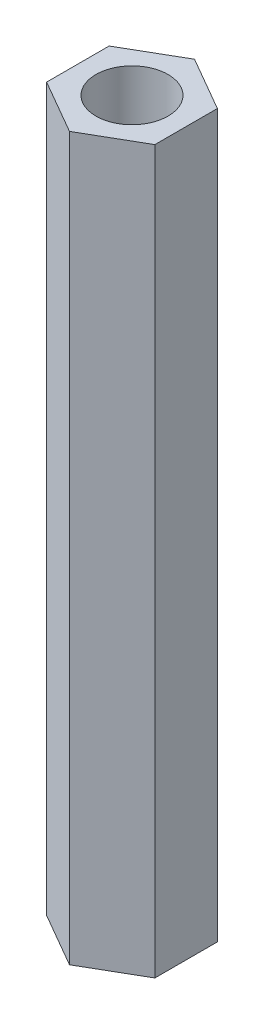
ISO-10303-21;
HEADER;
FILE_DESCRIPTION(('STEP AP214'),'2;1');
FILE_NAME('part.step','',(''),(''),'','','');
FILE_SCHEMA(('AUTOMOTIVE_DESIGN { 1 0 10303 214 1 1 1 1 }'));
ENDSEC;
DATA;
#1=APPLICATION_CONTEXT('core data for automotive mechanical design processes');
#2=APPLICATION_PROTOCOL_DEFINITION('international standard','automotive_design',2000,#1);
#3=PRODUCT_CONTEXT('',#1,'mechanical');
#4=PRODUCT('Part','Part','',(#3));
#5=PRODUCT_RELATED_PRODUCT_CATEGORY('part','',(#4));
#6=PRODUCT_DEFINITION_FORMATION('','',#4);
#7=PRODUCT_DEFINITION_CONTEXT('part definition',#1,'design');
#8=PRODUCT_DEFINITION('design','',#6,#7);
#9=PRODUCT_DEFINITION_SHAPE('','',#8);
#10=(LENGTH_UNIT() NAMED_UNIT(*) SI_UNIT(.MILLI.,.METRE.));
#11=(NAMED_UNIT(*) PLANE_ANGLE_UNIT() SI_UNIT($,.RADIAN.));
#12=(NAMED_UNIT(*) SI_UNIT($,.STERADIAN.) SOLID_ANGLE_UNIT());
#13=UNCERTAINTY_MEASURE_WITH_UNIT(LENGTH_MEASURE(1.E-05),#10,'distance_accuracy_value','');
#14=(GEOMETRIC_REPRESENTATION_CONTEXT(3) GLOBAL_UNCERTAINTY_ASSIGNED_CONTEXT((#13)) GLOBAL_UNIT_ASSIGNED_CONTEXT((#10,
#11,#12)) REPRESENTATION_CONTEXT('',''));
#15=CARTESIAN_POINT('',(0.,0.,0.));
#16=DIRECTION('',(0.,0.,1.));
#17=DIRECTION('',(1.,0.,0.));
#18=AXIS2_PLACEMENT_3D('',#15,#16,#17);
#19=CARTESIAN_POINT('',(0.,20.,0.));
#20=DIRECTION('',(0.,1.,0.));
#21=DIRECTION('',(0.,0.,1.));
#22=AXIS2_PLACEMENT_3D('',#19,#20,#21);
#23=PLANE('',#22);
#24=DIRECTION('',(0.866025403784442,0.,0.499999999999995));
#25=VECTOR('',#24,1.);
#26=CARTESIAN_POINT('',(-1.49999999999999,20.,0.866025403784455));
#27=LINE('',#26,#25);
#28=CARTESIAN_POINT('',(-1.49999999999999,20.,0.866025403784455));
#29=VERTEX_POINT('',#28);
#30=CARTESIAN_POINT('',(0.,20.,1.73205080756888));
#31=VERTEX_POINT('',#30);
#32=EDGE_CURVE('E164',#29,#31,#27,.T.);
#33=ORIENTED_EDGE('',*,*,#32,.T.);
#34=DIRECTION('',(0.866025403784438,0.,-0.500000000000001));
#35=VECTOR('',#34,1.);
#36=CARTESIAN_POINT('',(0.,20.,1.73205080756888));
#37=LINE('',#36,#35);
#38=CARTESIAN_POINT('',(1.5,20.,0.866025403784434));
#39=VERTEX_POINT('',#38);
#40=EDGE_CURVE('E110',#31,#39,#37,.T.);
#41=ORIENTED_EDGE('',*,*,#40,.T.);
#42=DIRECTION('',(0.,0.,-1.));
#43=VECTOR('',#42,1.);
#44=CARTESIAN_POINT('',(1.5,20.,0.866025403784434));
#45=LINE('',#44,#43);
#46=CARTESIAN_POINT('',(1.49999999999999,20.,-0.866025403784445));
#47=VERTEX_POINT('',#46);
#48=EDGE_CURVE('E124',#39,#47,#45,.T.);
#49=ORIENTED_EDGE('',*,*,#48,.T.);
#50=DIRECTION('',(-0.866025403784442,0.,-0.499999999999995));
#51=VECTOR('',#50,1.);
#52=CARTESIAN_POINT('',(1.49999999999999,20.,-0.866025403784445));
#53=LINE('',#52,#51);
#54=CARTESIAN_POINT('',(0.,20.,-1.73205080756887));
#55=VERTEX_POINT('',#54);
#56=EDGE_CURVE('E118',#47,#55,#53,.T.);
#57=ORIENTED_EDGE('',*,*,#56,.T.);
#58=DIRECTION('',(-0.866025403784435,0.,0.500000000000007));
#59=VECTOR('',#58,1.);
#60=CARTESIAN_POINT('',(0.,20.,-1.73205080756887));
#61=LINE('',#60,#59);
#62=CARTESIAN_POINT('',(-1.50000000000001,20.,-0.866025403784424));
#63=VERTEX_POINT('',#62);
#64=EDGE_CURVE('E122',#55,#63,#61,.T.);
#65=ORIENTED_EDGE('',*,*,#64,.T.);
#66=DIRECTION('',(0.,0.,1.));
#67=VECTOR('',#66,1.);
#68=CARTESIAN_POINT('',(-1.50000000000001,20.,-0.866025403784424));
#69=LINE('',#68,#67);
#70=EDGE_CURVE('E65',#63,#29,#69,.T.);
#71=ORIENTED_EDGE('',*,*,#70,.T.);
#72=EDGE_LOOP('',(#33,#41,#49,#57,#65,#71));
#73=FACE_BOUND('',#72,.T.);
#74=CARTESIAN_POINT('',(0.,20.,0.));
#75=DIRECTION('',(0.,1.,0.));
#76=DIRECTION('',(0.,0.,1.));
#77=AXIS2_PLACEMENT_3D('',#74,#75,#76);
#78=CIRCLE('',#77,1.);
#79=CARTESIAN_POINT('',(0.,20.,1.));
#80=VERTEX_POINT('',#79);
#81=EDGE_CURVE('E152',#80,#80,#78,.T.);
#82=ORIENTED_EDGE('',*,*,#81,.F.);
#83=EDGE_LOOP('',(#82));
#84=FACE_BOUND('',#83,.T.);
#85=ADVANCED_FACE('F44',(#73,#84),#23,.T.);
#86=CARTESIAN_POINT('',(0.,0.,0.));
#87=DIRECTION('',(0.,1.,0.));
#88=DIRECTION('',(0.,0.,1.));
#89=AXIS2_PLACEMENT_3D('',#86,#87,#88);
#90=PLANE('',#89);
#91=DIRECTION('',(0.866025403784442,0.,0.499999999999995));
#92=VECTOR('',#91,1.);
#93=CARTESIAN_POINT('',(-1.49999999999999,0.,0.866025403784455));
#94=LINE('',#93,#92);
#95=CARTESIAN_POINT('',(-1.49999999999999,0.,0.866025403784455));
#96=VERTEX_POINT('',#95);
#97=CARTESIAN_POINT('',(0.,0.,1.73205080756888));
#98=VERTEX_POINT('',#97);
#99=EDGE_CURVE('E147',#96,#98,#94,.T.);
#100=ORIENTED_EDGE('',*,*,#99,.F.);
#101=DIRECTION('',(0.,0.,1.));
#102=VECTOR('',#101,1.);
#103=CARTESIAN_POINT('',(-1.50000000000001,0.,-0.866025403784424));
#104=LINE('',#103,#102);
#105=CARTESIAN_POINT('',(-1.50000000000001,0.,-0.866025403784424));
#106=VERTEX_POINT('',#105);
#107=EDGE_CURVE('E101',#106,#96,#104,.T.);
#108=ORIENTED_EDGE('',*,*,#107,.F.);
#109=DIRECTION('',(-0.866025403784435,0.,0.500000000000007));
#110=VECTOR('',#109,1.);
#111=CARTESIAN_POINT('',(0.,0.,-1.73205080756887));
#112=LINE('',#111,#110);
#113=CARTESIAN_POINT('',(0.,0.,-1.73205080756887));
#114=VERTEX_POINT('',#113);
#115=EDGE_CURVE('E95',#114,#106,#112,.T.);
#116=ORIENTED_EDGE('',*,*,#115,.F.);
#117=DIRECTION('',(-0.866025403784442,0.,-0.499999999999995));
#118=VECTOR('',#117,1.);
#119=CARTESIAN_POINT('',(1.49999999999999,0.,-0.866025403784445));
#120=LINE('',#119,#118);
#121=CARTESIAN_POINT('',(1.49999999999999,0.,-0.866025403784445));
#122=VERTEX_POINT('',#121);
#123=EDGE_CURVE('E133',#122,#114,#120,.T.);
#124=ORIENTED_EDGE('',*,*,#123,.F.);
#125=DIRECTION('',(0.,0.,-1.));
#126=VECTOR('',#125,1.);
#127=CARTESIAN_POINT('',(1.5,0.,0.866025403784434));
#128=LINE('',#127,#126);
#129=CARTESIAN_POINT('',(1.5,0.,0.866025403784434));
#130=VERTEX_POINT('',#129);
#131=EDGE_CURVE('E155',#130,#122,#128,.T.);
#132=ORIENTED_EDGE('',*,*,#131,.F.);
#133=DIRECTION('',(0.866025403784438,0.,-0.500000000000001));
#134=VECTOR('',#133,1.);
#135=CARTESIAN_POINT('',(0.,0.,1.73205080756888));
#136=LINE('',#135,#134);
#137=EDGE_CURVE('E151',#98,#130,#136,.T.);
#138=ORIENTED_EDGE('',*,*,#137,.F.);
#139=EDGE_LOOP('',(#100,#108,#116,#124,#132,#138));
#140=FACE_BOUND('',#139,.T.);
#141=CARTESIAN_POINT('',(0.,0.,0.));
#142=DIRECTION('',(0.,1.,0.));
#143=DIRECTION('',(0.,0.,1.));
#144=AXIS2_PLACEMENT_3D('',#141,#142,#143);
#145=CIRCLE('',#144,1.);
#146=CARTESIAN_POINT('',(0.,0.,1.));
#147=VERTEX_POINT('',#146);
#148=EDGE_CURVE('E269',#147,#147,#145,.T.);
#149=ORIENTED_EDGE('',*,*,#148,.T.);
#150=EDGE_LOOP('',(#149));
#151=FACE_BOUND('',#150,.T.);
#152=ADVANCED_FACE('F177',(#140,#151),#90,.F.);
#153=CARTESIAN_POINT('',(-1.49999999999999,20.,0.866025403784455));
#154=DIRECTION('',(0.499999999999995,0.,-0.866025403784442));
#155=DIRECTION('',(-0.866025403784442,0.,-0.499999999999995));
#156=AXIS2_PLACEMENT_3D('',#153,#154,#155);
#157=PLANE('',#156);
#158=ORIENTED_EDGE('',*,*,#99,.T.);
#159=DIRECTION('',(0.,-1.,0.));
#160=VECTOR('',#159,1.);
#161=CARTESIAN_POINT('',(0.,20.,1.73205080756888));
#162=LINE('',#161,#160);
#163=EDGE_CURVE('E11',#31,#98,#162,.T.);
#164=ORIENTED_EDGE('',*,*,#163,.F.);
#165=ORIENTED_EDGE('',*,*,#32,.F.);
#166=DIRECTION('',(0.,-1.,0.));
#167=VECTOR('',#166,1.);
#168=CARTESIAN_POINT('',(-1.49999999999999,20.,0.866025403784455));
#169=LINE('',#168,#167);
#170=EDGE_CURVE('E143',#29,#96,#169,.T.);
#171=ORIENTED_EDGE('',*,*,#170,.T.);
#172=EDGE_LOOP('',(#158,#164,#165,#171));
#173=FACE_BOUND('',#172,.T.);
#174=ADVANCED_FACE('F46',(#173),#157,.F.);
#175=CARTESIAN_POINT('',(0.,20.,1.73205080756888));
#176=DIRECTION('',(-0.500000000000001,0.,-0.866025403784438));
#177=DIRECTION('',(-0.866025403784438,0.,0.500000000000001));
#178=AXIS2_PLACEMENT_3D('',#175,#176,#177);
#179=PLANE('',#178);
#180=ORIENTED_EDGE('',*,*,#137,.T.);
#181=DIRECTION('',(0.,-1.,0.));
#182=VECTOR('',#181,1.);
#183=CARTESIAN_POINT('',(1.5,20.,0.866025403784434));
#184=LINE('',#183,#182);
#185=EDGE_CURVE('E54',#39,#130,#184,.T.);
#186=ORIENTED_EDGE('',*,*,#185,.F.);
#187=ORIENTED_EDGE('',*,*,#40,.F.);
#188=ORIENTED_EDGE('',*,*,#163,.T.);
#189=EDGE_LOOP('',(#180,#186,#187,#188));
#190=FACE_BOUND('',#189,.T.);
#191=ADVANCED_FACE('F202',(#190),#179,.F.);
#192=CARTESIAN_POINT('',(1.5,20.,0.866025403784434));
#193=DIRECTION('',(-1.,0.,0.));
#194=DIRECTION('',(0.,0.,1.));
#195=AXIS2_PLACEMENT_3D('',#192,#193,#194);
#196=PLANE('',#195);
#197=ORIENTED_EDGE('',*,*,#131,.T.);
#198=DIRECTION('',(0.,-1.,0.));
#199=VECTOR('',#198,1.);
#200=CARTESIAN_POINT('',(1.49999999999999,20.,-0.866025403784445));
#201=LINE('',#200,#199);
#202=EDGE_CURVE('E135',#47,#122,#201,.T.);
#203=ORIENTED_EDGE('',*,*,#202,.F.);
#204=ORIENTED_EDGE('',*,*,#48,.F.);
#205=ORIENTED_EDGE('',*,*,#185,.T.);
#206=EDGE_LOOP('',(#197,#203,#204,#205));
#207=FACE_BOUND('',#206,.T.);
#208=ADVANCED_FACE('F174',(#207),#196,.F.);
#209=CARTESIAN_POINT('',(1.49999999999999,20.,-0.866025403784445));
#210=DIRECTION('',(-0.499999999999995,0.,0.866025403784442));
#211=DIRECTION('',(0.866025403784442,0.,0.499999999999995));
#212=AXIS2_PLACEMENT_3D('',#209,#210,#211);
#213=PLANE('',#212);
#214=ORIENTED_EDGE('',*,*,#123,.T.);
#215=DIRECTION('',(0.,-1.,0.));
#216=VECTOR('',#215,1.);
#217=CARTESIAN_POINT('',(0.,20.,-1.73205080756887));
#218=LINE('',#217,#216);
#219=EDGE_CURVE('E130',#55,#114,#218,.T.);
#220=ORIENTED_EDGE('',*,*,#219,.F.);
#221=ORIENTED_EDGE('',*,*,#56,.F.);
#222=ORIENTED_EDGE('',*,*,#202,.T.);
#223=EDGE_LOOP('',(#214,#220,#221,#222));
#224=FACE_BOUND('',#223,.T.);
#225=ADVANCED_FACE('F131',(#224),#213,.F.);
#226=CARTESIAN_POINT('',(0.,20.,-1.73205080756887));
#227=DIRECTION('',(0.500000000000007,0.,0.866025403784435));
#228=DIRECTION('',(0.866025403784435,0.,-0.500000000000007));
#229=AXIS2_PLACEMENT_3D('',#226,#227,#228);
#230=PLANE('',#229);
#231=ORIENTED_EDGE('',*,*,#115,.T.);
#232=DIRECTION('',(0.,-1.,0.));
#233=VECTOR('',#232,1.);
#234=CARTESIAN_POINT('',(-1.50000000000001,20.,-0.866025403784424));
#235=LINE('',#234,#233);
#236=EDGE_CURVE('E136',#63,#106,#235,.T.);
#237=ORIENTED_EDGE('',*,*,#236,.F.);
#238=ORIENTED_EDGE('',*,*,#64,.F.);
#239=ORIENTED_EDGE('',*,*,#219,.T.);
#240=EDGE_LOOP('',(#231,#237,#238,#239));
#241=FACE_BOUND('',#240,.T.);
#242=ADVANCED_FACE('F138',(#241),#230,.F.);
#243=CARTESIAN_POINT('',(-1.50000000000001,20.,-0.866025403784424));
#244=DIRECTION('',(1.,0.,0.));
#245=DIRECTION('',(0.,0.,-1.));
#246=AXIS2_PLACEMENT_3D('',#243,#244,#245);
#247=PLANE('',#246);
#248=ORIENTED_EDGE('',*,*,#107,.T.);
#249=ORIENTED_EDGE('',*,*,#170,.F.);
#250=ORIENTED_EDGE('',*,*,#70,.F.);
#251=ORIENTED_EDGE('',*,*,#236,.T.);
#252=EDGE_LOOP('',(#248,#249,#250,#251));
#253=FACE_BOUND('',#252,.T.);
#254=ADVANCED_FACE('F182',(#253),#247,.F.);
#255=CARTESIAN_POINT('',(0.,20.,0.));
#256=DIRECTION('',(0.,-1.,0.));
#257=DIRECTION('',(0.,0.,-1.));
#258=AXIS2_PLACEMENT_3D('',#255,#256,#257);
#259=CYLINDRICAL_SURFACE('',#258,1.);
#260=ORIENTED_EDGE('',*,*,#81,.T.);
#261=EDGE_LOOP('',(#260));
#262=FACE_BOUND('',#261,.T.);
#263=ORIENTED_EDGE('',*,*,#148,.F.);
#264=EDGE_LOOP('',(#263));
#265=FACE_BOUND('',#264,.T.);
#266=ADVANCED_FACE('F184',(#262,#265),#259,.F.);
#267=CLOSED_SHELL('',(#85,#152,#174,#191,#208,#225,#242,#254,#266));
#268=MANIFOLD_SOLID_BREP('B2',#267);
#269=ADVANCED_BREP_SHAPE_REPRESENTATION('',(#18,#268),#14);
#270=SHAPE_DEFINITION_REPRESENTATION(#9,#269);
ENDSEC;
END-ISO-10303-21;
